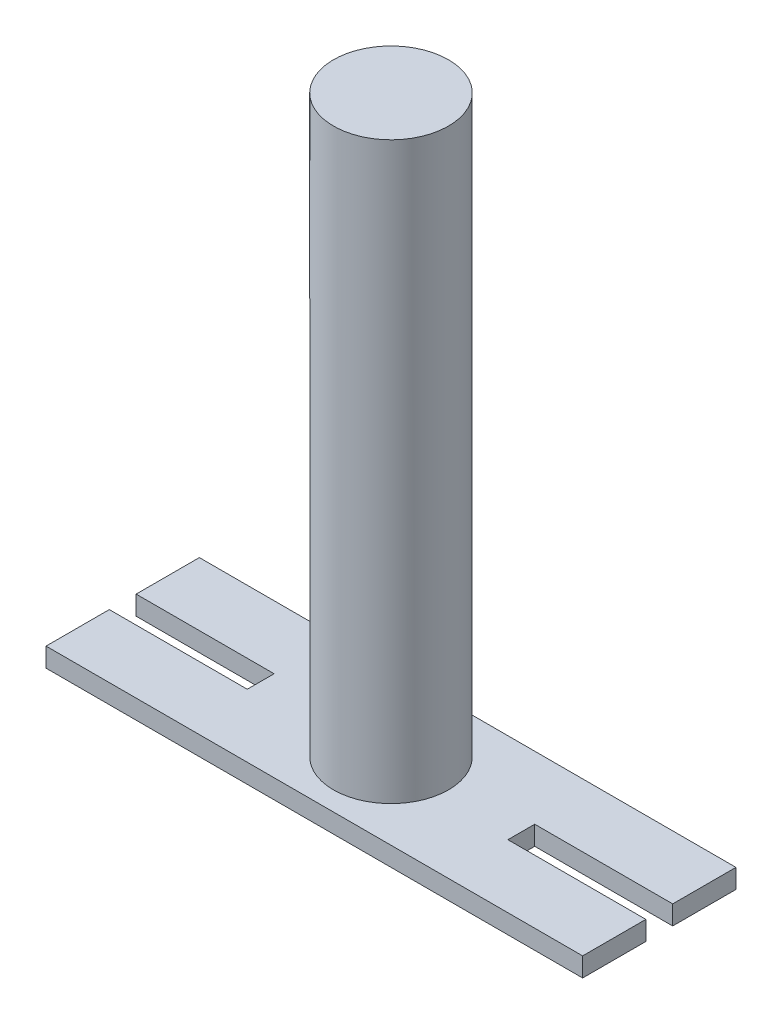
ISO-10303-21;
HEADER;
FILE_DESCRIPTION(('STEP AP214'),'2;1');
FILE_NAME('part.step','',(''),(''),'','','');
FILE_SCHEMA(('AUTOMOTIVE_DESIGN { 1 0 10303 214 1 1 1 1 }'));
ENDSEC;
DATA;
#1=APPLICATION_CONTEXT('core data for automotive mechanical design processes');
#2=APPLICATION_PROTOCOL_DEFINITION('international standard','automotive_design',2000,#1);
#3=PRODUCT_CONTEXT('',#1,'mechanical');
#4=PRODUCT('Part','Part','',(#3));
#5=PRODUCT_RELATED_PRODUCT_CATEGORY('part','',(#4));
#6=PRODUCT_DEFINITION_FORMATION('','',#4);
#7=PRODUCT_DEFINITION_CONTEXT('part definition',#1,'design');
#8=PRODUCT_DEFINITION('design','',#6,#7);
#9=PRODUCT_DEFINITION_SHAPE('','',#8);
#10=(LENGTH_UNIT() NAMED_UNIT(*) SI_UNIT(.MILLI.,.METRE.));
#11=(NAMED_UNIT(*) PLANE_ANGLE_UNIT() SI_UNIT($,.RADIAN.));
#12=(NAMED_UNIT(*) SI_UNIT($,.STERADIAN.) SOLID_ANGLE_UNIT());
#13=UNCERTAINTY_MEASURE_WITH_UNIT(LENGTH_MEASURE(1.E-05),#10,'distance_accuracy_value','');
#14=(GEOMETRIC_REPRESENTATION_CONTEXT(3) GLOBAL_UNCERTAINTY_ASSIGNED_CONTEXT((#13)) GLOBAL_UNIT_ASSIGNED_CONTEXT((#10,
#11,#12)) REPRESENTATION_CONTEXT('',''));
#15=CARTESIAN_POINT('',(0.,0.,0.));
#16=DIRECTION('',(0.,0.,1.));
#17=DIRECTION('',(1.,0.,0.));
#18=AXIS2_PLACEMENT_3D('',#15,#16,#17);
#19=CARTESIAN_POINT('',(0.,127.,0.));
#20=DIRECTION('',(0.,1.,0.));
#21=DIRECTION('',(0.,0.,1.));
#22=AXIS2_PLACEMENT_3D('',#19,#20,#21);
#23=PLANE('',#22);
#24=CARTESIAN_POINT('',(0.,127.,0.));
#25=DIRECTION('',(0.,1.,0.));
#26=DIRECTION('',(0.,0.,1.));
#27=AXIS2_PLACEMENT_3D('',#24,#25,#26);
#28=CIRCLE('',#27,381.);
#29=CARTESIAN_POINT('',(0.,127.,381.));
#30=VERTEX_POINT('',#29);
#31=EDGE_CURVE('E12',#30,#30,#28,.T.);
#32=ORIENTED_EDGE('',*,*,#31,.F.);
#33=EDGE_LOOP('',(#32));
#34=FACE_BOUND('',#33,.T.);
#35=DIRECTION('',(0.,0.,1.));
#36=VECTOR('',#35,1.);
#37=CARTESIAN_POINT('',(1778.,127.,9.42007414833465E-13));
#38=LINE('',#37,#36);
#39=CARTESIAN_POINT('',(1778.,127.,88.8999999999994));
#40=VERTEX_POINT('',#39);
#41=CARTESIAN_POINT('',(1778.,127.,508.));
#42=VERTEX_POINT('',#41);
#43=EDGE_CURVE('E222',#40,#42,#38,.T.);
#44=ORIENTED_EDGE('',*,*,#43,.F.);
#45=DIRECTION('',(-1.,0.,0.));
#46=VECTOR('',#45,1.);
#47=CARTESIAN_POINT('',(0.,127.,88.9000000000002));
#48=LINE('',#47,#46);
#49=CARTESIAN_POINT('',(863.6,127.,88.8999999999998));
#50=VERTEX_POINT('',#49);
#51=EDGE_CURVE('E246',#40,#50,#48,.T.);
#52=ORIENTED_EDGE('',*,*,#51,.T.);
#53=DIRECTION('',(0.,0.,-1.));
#54=VECTOR('',#53,1.);
#55=CARTESIAN_POINT('',(863.6,127.,-1.07850236677872E-12));
#56=LINE('',#55,#54);
#57=CARTESIAN_POINT('',(863.6,127.,-88.9000000000004));
#58=VERTEX_POINT('',#57);
#59=EDGE_CURVE('E314',#50,#58,#56,.T.);
#60=ORIENTED_EDGE('',*,*,#59,.T.);
#61=DIRECTION('',(-1.,0.,0.));
#62=VECTOR('',#61,1.);
#63=CARTESIAN_POINT('',(0.,127.,-88.9000000000004));
#64=LINE('',#63,#62);
#65=CARTESIAN_POINT('',(1778.,127.,-88.9000000000004));
#66=VERTEX_POINT('',#65);
#67=EDGE_CURVE('E310',#66,#58,#64,.T.);
#68=ORIENTED_EDGE('',*,*,#67,.F.);
#69=DIRECTION('',(0.,0.,1.));
#70=VECTOR('',#69,1.);
#71=CARTESIAN_POINT('',(1778.,127.,0.));
#72=LINE('',#71,#70);
#73=CARTESIAN_POINT('',(1778.,127.,-508.));
#74=VERTEX_POINT('',#73);
#75=EDGE_CURVE('E313',#74,#66,#72,.T.);
#76=ORIENTED_EDGE('',*,*,#75,.F.);
#77=DIRECTION('',(-1.,0.,0.));
#78=VECTOR('',#77,1.);
#79=CARTESIAN_POINT('',(0.,127.,-508.));
#80=LINE('',#79,#78);
#81=CARTESIAN_POINT('',(-1778.,127.,-508.));
#82=VERTEX_POINT('',#81);
#83=EDGE_CURVE('E316',#74,#82,#80,.T.);
#84=ORIENTED_EDGE('',*,*,#83,.T.);
#85=DIRECTION('',(0.,0.,1.));
#86=VECTOR('',#85,1.);
#87=CARTESIAN_POINT('',(-1778.,127.,0.));
#88=LINE('',#87,#86);
#89=CARTESIAN_POINT('',(-1778.,127.,-88.9));
#90=VERTEX_POINT('',#89);
#91=EDGE_CURVE('E322',#82,#90,#88,.T.);
#92=ORIENTED_EDGE('',*,*,#91,.T.);
#93=DIRECTION('',(1.,0.,0.));
#94=VECTOR('',#93,1.);
#95=CARTESIAN_POINT('',(0.,127.,-88.9000000000004));
#96=LINE('',#95,#94);
#97=CARTESIAN_POINT('',(-863.6,127.,-88.9000000000002));
#98=VERTEX_POINT('',#97);
#99=EDGE_CURVE('E187',#90,#98,#96,.T.);
#100=ORIENTED_EDGE('',*,*,#99,.T.);
#101=DIRECTION('',(0.,0.,-1.));
#102=VECTOR('',#101,1.);
#103=CARTESIAN_POINT('',(-863.6,127.,0.));
#104=LINE('',#103,#102);
#105=CARTESIAN_POINT('',(-863.6,127.,88.9000000000002));
#106=VERTEX_POINT('',#105);
#107=EDGE_CURVE('E185',#106,#98,#104,.T.);
#108=ORIENTED_EDGE('',*,*,#107,.F.);
#109=DIRECTION('',(1.,0.,0.));
#110=VECTOR('',#109,1.);
#111=CARTESIAN_POINT('',(0.,127.,88.9000000000002));
#112=LINE('',#111,#110);
#113=CARTESIAN_POINT('',(-1778.,127.,88.9000000000002));
#114=VERTEX_POINT('',#113);
#115=EDGE_CURVE('E169',#114,#106,#112,.T.);
#116=ORIENTED_EDGE('',*,*,#115,.F.);
#117=DIRECTION('',(0.,0.,1.));
#118=VECTOR('',#117,1.);
#119=CARTESIAN_POINT('',(-1778.,127.,1.88401482966693E-12));
#120=LINE('',#119,#118);
#121=CARTESIAN_POINT('',(-1778.,127.,508.));
#122=VERTEX_POINT('',#121);
#123=EDGE_CURVE('E176',#114,#122,#120,.T.);
#124=ORIENTED_EDGE('',*,*,#123,.T.);
#125=DIRECTION('',(-1.,0.,0.));
#126=VECTOR('',#125,1.);
#127=CARTESIAN_POINT('',(0.,127.,508.));
#128=LINE('',#127,#126);
#129=EDGE_CURVE('E180',#42,#122,#128,.T.);
#130=ORIENTED_EDGE('',*,*,#129,.F.);
#131=EDGE_LOOP('',(#44,#52,#60,#68,#76,#84,#92,#100,#108,#116,#124,#130));
#132=FACE_BOUND('',#131,.T.);
#133=ADVANCED_FACE('F72',(#34,#132),#23,.T.);
#134=CARTESIAN_POINT('',(0.,0.,0.));
#135=DIRECTION('',(0.,1.,0.));
#136=DIRECTION('',(0.,0.,1.));
#137=AXIS2_PLACEMENT_3D('',#134,#135,#136);
#138=PLANE('',#137);
#139=DIRECTION('',(0.,0.,1.));
#140=VECTOR('',#139,1.);
#141=CARTESIAN_POINT('',(1778.,0.,9.42007414833465E-13));
#142=LINE('',#141,#140);
#143=CARTESIAN_POINT('',(1778.,0.,88.8999999999994));
#144=VERTEX_POINT('',#143);
#145=CARTESIAN_POINT('',(1778.,0.,508.));
#146=VERTEX_POINT('',#145);
#147=EDGE_CURVE('E192',#144,#146,#142,.T.);
#148=ORIENTED_EDGE('',*,*,#147,.T.);
#149=DIRECTION('',(-1.,0.,0.));
#150=VECTOR('',#149,1.);
#151=CARTESIAN_POINT('',(0.,0.,508.));
#152=LINE('',#151,#150);
#153=CARTESIAN_POINT('',(-1778.,0.,508.));
#154=VERTEX_POINT('',#153);
#155=EDGE_CURVE('E219',#146,#154,#152,.T.);
#156=ORIENTED_EDGE('',*,*,#155,.T.);
#157=DIRECTION('',(0.,0.,1.));
#158=VECTOR('',#157,1.);
#159=CARTESIAN_POINT('',(-1778.,0.,1.88401482966693E-12));
#160=LINE('',#159,#158);
#161=CARTESIAN_POINT('',(-1778.,0.,88.9000000000002));
#162=VERTEX_POINT('',#161);
#163=EDGE_CURVE('E217',#162,#154,#160,.T.);
#164=ORIENTED_EDGE('',*,*,#163,.F.);
#165=DIRECTION('',(1.,0.,0.));
#166=VECTOR('',#165,1.);
#167=CARTESIAN_POINT('',(0.,0.,88.9000000000002));
#168=LINE('',#167,#166);
#169=CARTESIAN_POINT('',(-863.6,0.,88.9000000000002));
#170=VERTEX_POINT('',#169);
#171=EDGE_CURVE('E171',#162,#170,#168,.T.);
#172=ORIENTED_EDGE('',*,*,#171,.T.);
#173=DIRECTION('',(0.,0.,-1.));
#174=VECTOR('',#173,1.);
#175=CARTESIAN_POINT('',(-863.6,0.,0.));
#176=LINE('',#175,#174);
#177=CARTESIAN_POINT('',(-863.6,0.,-88.9000000000002));
#178=VERTEX_POINT('',#177);
#179=EDGE_CURVE('E213',#170,#178,#176,.T.);
#180=ORIENTED_EDGE('',*,*,#179,.T.);
#181=DIRECTION('',(1.,0.,0.));
#182=VECTOR('',#181,1.);
#183=CARTESIAN_POINT('',(0.,0.,-88.9000000000004));
#184=LINE('',#183,#182);
#185=CARTESIAN_POINT('',(-1778.,0.,-88.9));
#186=VERTEX_POINT('',#185);
#187=EDGE_CURVE('E210',#186,#178,#184,.T.);
#188=ORIENTED_EDGE('',*,*,#187,.F.);
#189=DIRECTION('',(0.,0.,1.));
#190=VECTOR('',#189,1.);
#191=CARTESIAN_POINT('',(-1778.,0.,0.));
#192=LINE('',#191,#190);
#193=CARTESIAN_POINT('',(-1778.,0.,-508.));
#194=VERTEX_POINT('',#193);
#195=EDGE_CURVE('E208',#194,#186,#192,.T.);
#196=ORIENTED_EDGE('',*,*,#195,.F.);
#197=DIRECTION('',(-1.,0.,0.));
#198=VECTOR('',#197,1.);
#199=CARTESIAN_POINT('',(0.,0.,-508.));
#200=LINE('',#199,#198);
#201=CARTESIAN_POINT('',(1778.,0.,-508.));
#202=VERTEX_POINT('',#201);
#203=EDGE_CURVE('E206',#202,#194,#200,.T.);
#204=ORIENTED_EDGE('',*,*,#203,.F.);
#205=DIRECTION('',(0.,0.,1.));
#206=VECTOR('',#205,1.);
#207=CARTESIAN_POINT('',(1778.,0.,0.));
#208=LINE('',#207,#206);
#209=CARTESIAN_POINT('',(1778.,0.,-88.9000000000004));
#210=VERTEX_POINT('',#209);
#211=EDGE_CURVE('E203',#202,#210,#208,.T.);
#212=ORIENTED_EDGE('',*,*,#211,.T.);
#213=DIRECTION('',(-1.,0.,0.));
#214=VECTOR('',#213,1.);
#215=CARTESIAN_POINT('',(0.,0.,-88.9000000000004));
#216=LINE('',#215,#214);
#217=CARTESIAN_POINT('',(863.6,0.,-88.9000000000004));
#218=VERTEX_POINT('',#217);
#219=EDGE_CURVE('E200',#210,#218,#216,.T.);
#220=ORIENTED_EDGE('',*,*,#219,.T.);
#221=DIRECTION('',(0.,0.,-1.));
#222=VECTOR('',#221,1.);
#223=CARTESIAN_POINT('',(863.6,0.,-1.07850236677872E-12));
#224=LINE('',#223,#222);
#225=CARTESIAN_POINT('',(863.6,0.,88.8999999999998));
#226=VERTEX_POINT('',#225);
#227=EDGE_CURVE('E197',#226,#218,#224,.T.);
#228=ORIENTED_EDGE('',*,*,#227,.F.);
#229=DIRECTION('',(-1.,0.,0.));
#230=VECTOR('',#229,1.);
#231=CARTESIAN_POINT('',(0.,0.,88.9000000000002));
#232=LINE('',#231,#230);
#233=EDGE_CURVE('E194',#144,#226,#232,.T.);
#234=ORIENTED_EDGE('',*,*,#233,.F.);
#235=EDGE_LOOP('',(#148,#156,#164,#172,#180,#188,#196,#204,#212,#220,#228,#234));
#236=FACE_BOUND('',#235,.T.);
#237=CARTESIAN_POINT('',(4.44089209850063E-13,0.,-1.11022302462516E-13));
#238=DIRECTION('',(0.,1.,0.));
#239=DIRECTION('',(0.,0.,1.));
#240=AXIS2_PLACEMENT_3D('',#237,#238,#239);
#241=CIRCLE('',#240,254.);
#242=CARTESIAN_POINT('',(4.44089209850063E-13,0.,254.));
#243=VERTEX_POINT('',#242);
#244=EDGE_CURVE('E195',#243,#243,#241,.T.);
#245=ORIENTED_EDGE('',*,*,#244,.T.);
#246=EDGE_LOOP('',(#245));
#247=FACE_BOUND('',#246,.T.);
#248=ADVANCED_FACE('F249',(#236,#247),#138,.F.);
#249=CARTESIAN_POINT('',(1778.,127.,9.42007414833465E-13));
#250=DIRECTION('',(1.,0.,0.));
#251=DIRECTION('',(0.,0.,-1.));
#252=AXIS2_PLACEMENT_3D('',#249,#250,#251);
#253=PLANE('',#252);
#254=ORIENTED_EDGE('',*,*,#147,.F.);
#255=DIRECTION('',(0.,-1.,0.));
#256=VECTOR('',#255,1.);
#257=CARTESIAN_POINT('',(1778.,127.,88.8999999999994));
#258=LINE('',#257,#256);
#259=EDGE_CURVE('E81',#40,#144,#258,.T.);
#260=ORIENTED_EDGE('',*,*,#259,.F.);
#261=ORIENTED_EDGE('',*,*,#43,.T.);
#262=DIRECTION('',(0.,-1.,0.));
#263=VECTOR('',#262,1.);
#264=CARTESIAN_POINT('',(1778.,127.,508.));
#265=LINE('',#264,#263);
#266=EDGE_CURVE('E89',#42,#146,#265,.T.);
#267=ORIENTED_EDGE('',*,*,#266,.T.);
#268=EDGE_LOOP('',(#254,#260,#261,#267));
#269=FACE_BOUND('',#268,.T.);
#270=ADVANCED_FACE('F74',(#269),#253,.T.);
#271=CARTESIAN_POINT('',(0.,127.,88.9000000000002));
#272=DIRECTION('',(0.,0.,1.));
#273=DIRECTION('',(1.,0.,0.));
#274=AXIS2_PLACEMENT_3D('',#271,#272,#273);
#275=PLANE('',#274);
#276=ORIENTED_EDGE('',*,*,#233,.T.);
#277=DIRECTION('',(0.,-1.,0.));
#278=VECTOR('',#277,1.);
#279=CARTESIAN_POINT('',(863.6,127.,88.8999999999998));
#280=LINE('',#279,#278);
#281=EDGE_CURVE('E240',#50,#226,#280,.T.);
#282=ORIENTED_EDGE('',*,*,#281,.F.);
#283=ORIENTED_EDGE('',*,*,#51,.F.);
#284=ORIENTED_EDGE('',*,*,#259,.T.);
#285=EDGE_LOOP('',(#276,#282,#283,#284));
#286=FACE_BOUND('',#285,.T.);
#287=ADVANCED_FACE('F244',(#286),#275,.F.);
#288=CARTESIAN_POINT('',(863.6,127.,-1.07850236677872E-12));
#289=DIRECTION('',(-1.,0.,0.));
#290=DIRECTION('',(0.,0.,1.));
#291=AXIS2_PLACEMENT_3D('',#288,#289,#290);
#292=PLANE('',#291);
#293=ORIENTED_EDGE('',*,*,#227,.T.);
#294=DIRECTION('',(0.,-1.,0.));
#295=VECTOR('',#294,1.);
#296=CARTESIAN_POINT('',(863.6,127.,-88.9000000000004));
#297=LINE('',#296,#295);
#298=EDGE_CURVE('E238',#58,#218,#297,.T.);
#299=ORIENTED_EDGE('',*,*,#298,.F.);
#300=ORIENTED_EDGE('',*,*,#59,.F.);
#301=ORIENTED_EDGE('',*,*,#281,.T.);
#302=EDGE_LOOP('',(#293,#299,#300,#301));
#303=FACE_BOUND('',#302,.T.);
#304=ADVANCED_FACE('F256',(#303),#292,.F.);
#305=CARTESIAN_POINT('',(0.,127.,-88.9000000000004));
#306=DIRECTION('',(0.,0.,1.));
#307=DIRECTION('',(1.,0.,0.));
#308=AXIS2_PLACEMENT_3D('',#305,#306,#307);
#309=PLANE('',#308);
#310=ORIENTED_EDGE('',*,*,#219,.F.);
#311=DIRECTION('',(0.,-1.,0.));
#312=VECTOR('',#311,1.);
#313=CARTESIAN_POINT('',(1778.,127.,-88.9000000000004));
#314=LINE('',#313,#312);
#315=EDGE_CURVE('E236',#66,#210,#314,.T.);
#316=ORIENTED_EDGE('',*,*,#315,.F.);
#317=ORIENTED_EDGE('',*,*,#67,.T.);
#318=ORIENTED_EDGE('',*,*,#298,.T.);
#319=EDGE_LOOP('',(#310,#316,#317,#318));
#320=FACE_BOUND('',#319,.T.);
#321=ADVANCED_FACE('F294',(#320),#309,.T.);
#322=CARTESIAN_POINT('',(1778.,127.,0.));
#323=DIRECTION('',(1.,0.,0.));
#324=DIRECTION('',(0.,0.,-1.));
#325=AXIS2_PLACEMENT_3D('',#322,#323,#324);
#326=PLANE('',#325);
#327=ORIENTED_EDGE('',*,*,#211,.F.);
#328=DIRECTION('',(0.,-1.,0.));
#329=VECTOR('',#328,1.);
#330=CARTESIAN_POINT('',(1778.,127.,-508.));
#331=LINE('',#330,#329);
#332=EDGE_CURVE('E234',#74,#202,#331,.T.);
#333=ORIENTED_EDGE('',*,*,#332,.F.);
#334=ORIENTED_EDGE('',*,*,#75,.T.);
#335=ORIENTED_EDGE('',*,*,#315,.T.);
#336=EDGE_LOOP('',(#327,#333,#334,#335));
#337=FACE_BOUND('',#336,.T.);
#338=ADVANCED_FACE('F290',(#337),#326,.T.);
#339=CARTESIAN_POINT('',(0.,127.,-508.));
#340=DIRECTION('',(0.,0.,1.));
#341=DIRECTION('',(1.,0.,0.));
#342=AXIS2_PLACEMENT_3D('',#339,#340,#341);
#343=PLANE('',#342);
#344=ORIENTED_EDGE('',*,*,#203,.T.);
#345=DIRECTION('',(0.,-1.,0.));
#346=VECTOR('',#345,1.);
#347=CARTESIAN_POINT('',(-1778.,127.,-508.));
#348=LINE('',#347,#346);
#349=EDGE_CURVE('E231',#82,#194,#348,.T.);
#350=ORIENTED_EDGE('',*,*,#349,.F.);
#351=ORIENTED_EDGE('',*,*,#83,.F.);
#352=ORIENTED_EDGE('',*,*,#332,.T.);
#353=EDGE_LOOP('',(#344,#350,#351,#352));
#354=FACE_BOUND('',#353,.T.);
#355=ADVANCED_FACE('F286',(#354),#343,.F.);
#356=CARTESIAN_POINT('',(-1778.,127.,0.));
#357=DIRECTION('',(1.,0.,0.));
#358=DIRECTION('',(0.,0.,-1.));
#359=AXIS2_PLACEMENT_3D('',#356,#357,#358);
#360=PLANE('',#359);
#361=ORIENTED_EDGE('',*,*,#195,.T.);
#362=DIRECTION('',(0.,-1.,0.));
#363=VECTOR('',#362,1.);
#364=CARTESIAN_POINT('',(-1778.,127.,-88.9));
#365=LINE('',#364,#363);
#366=EDGE_CURVE('E228',#90,#186,#365,.T.);
#367=ORIENTED_EDGE('',*,*,#366,.F.);
#368=ORIENTED_EDGE('',*,*,#91,.F.);
#369=ORIENTED_EDGE('',*,*,#349,.T.);
#370=EDGE_LOOP('',(#361,#367,#368,#369));
#371=FACE_BOUND('',#370,.T.);
#372=ADVANCED_FACE('F282',(#371),#360,.F.);
#373=CARTESIAN_POINT('',(0.,127.,-88.9000000000004));
#374=DIRECTION('',(0.,0.,-1.));
#375=DIRECTION('',(-1.,0.,0.));
#376=AXIS2_PLACEMENT_3D('',#373,#374,#375);
#377=PLANE('',#376);
#378=ORIENTED_EDGE('',*,*,#187,.T.);
#379=DIRECTION('',(0.,-1.,0.));
#380=VECTOR('',#379,1.);
#381=CARTESIAN_POINT('',(-863.6,127.,-88.9000000000002));
#382=LINE('',#381,#380);
#383=EDGE_CURVE('E226',#98,#178,#382,.T.);
#384=ORIENTED_EDGE('',*,*,#383,.F.);
#385=ORIENTED_EDGE('',*,*,#99,.F.);
#386=ORIENTED_EDGE('',*,*,#366,.T.);
#387=EDGE_LOOP('',(#378,#384,#385,#386));
#388=FACE_BOUND('',#387,.T.);
#389=ADVANCED_FACE('F278',(#388),#377,.F.);
#390=CARTESIAN_POINT('',(-863.6,127.,0.));
#391=DIRECTION('',(-1.,0.,0.));
#392=DIRECTION('',(0.,0.,1.));
#393=AXIS2_PLACEMENT_3D('',#390,#391,#392);
#394=PLANE('',#393);
#395=ORIENTED_EDGE('',*,*,#179,.F.);
#396=DIRECTION('',(0.,-1.,0.));
#397=VECTOR('',#396,1.);
#398=CARTESIAN_POINT('',(-863.6,127.,88.9000000000002));
#399=LINE('',#398,#397);
#400=EDGE_CURVE('E174',#106,#170,#399,.T.);
#401=ORIENTED_EDGE('',*,*,#400,.F.);
#402=ORIENTED_EDGE('',*,*,#107,.T.);
#403=ORIENTED_EDGE('',*,*,#383,.T.);
#404=EDGE_LOOP('',(#395,#401,#402,#403));
#405=FACE_BOUND('',#404,.T.);
#406=ADVANCED_FACE('F275',(#405),#394,.T.);
#407=CARTESIAN_POINT('',(0.,127.,88.9000000000002));
#408=DIRECTION('',(0.,0.,-1.));
#409=DIRECTION('',(-1.,0.,0.));
#410=AXIS2_PLACEMENT_3D('',#407,#408,#409);
#411=PLANE('',#410);
#412=ORIENTED_EDGE('',*,*,#171,.F.);
#413=DIRECTION('',(0.,-1.,0.));
#414=VECTOR('',#413,1.);
#415=CARTESIAN_POINT('',(-1778.,127.,88.9000000000002));
#416=LINE('',#415,#414);
#417=EDGE_CURVE('E165',#114,#162,#416,.T.);
#418=ORIENTED_EDGE('',*,*,#417,.F.);
#419=ORIENTED_EDGE('',*,*,#115,.T.);
#420=ORIENTED_EDGE('',*,*,#400,.T.);
#421=EDGE_LOOP('',(#412,#418,#419,#420));
#422=FACE_BOUND('',#421,.T.);
#423=ADVANCED_FACE('F167',(#422),#411,.T.);
#424=CARTESIAN_POINT('',(-1778.,127.,1.88401482966693E-12));
#425=DIRECTION('',(1.,0.,0.));
#426=DIRECTION('',(0.,0.,-1.));
#427=AXIS2_PLACEMENT_3D('',#424,#425,#426);
#428=PLANE('',#427);
#429=ORIENTED_EDGE('',*,*,#163,.T.);
#430=DIRECTION('',(0.,-1.,0.));
#431=VECTOR('',#430,1.);
#432=CARTESIAN_POINT('',(-1778.,127.,508.));
#433=LINE('',#432,#431);
#434=EDGE_CURVE('E128',#122,#154,#433,.T.);
#435=ORIENTED_EDGE('',*,*,#434,.F.);
#436=ORIENTED_EDGE('',*,*,#123,.F.);
#437=ORIENTED_EDGE('',*,*,#417,.T.);
#438=EDGE_LOOP('',(#429,#435,#436,#437));
#439=FACE_BOUND('',#438,.T.);
#440=ADVANCED_FACE('F177',(#439),#428,.F.);
#441=CARTESIAN_POINT('',(0.,127.,508.));
#442=DIRECTION('',(0.,0.,1.));
#443=DIRECTION('',(1.,0.,0.));
#444=AXIS2_PLACEMENT_3D('',#441,#442,#443);
#445=PLANE('',#444);
#446=ORIENTED_EDGE('',*,*,#155,.F.);
#447=ORIENTED_EDGE('',*,*,#266,.F.);
#448=ORIENTED_EDGE('',*,*,#129,.T.);
#449=ORIENTED_EDGE('',*,*,#434,.T.);
#450=EDGE_LOOP('',(#446,#447,#448,#449));
#451=FACE_BOUND('',#450,.T.);
#452=ADVANCED_FACE('F268',(#451),#445,.T.);
#453=CARTESIAN_POINT('',(4.44089209850063E-13,127.,-1.11022302462516E-13));
#454=DIRECTION('',(0.,-1.,0.));
#455=DIRECTION('',(0.,0.,-1.));
#456=AXIS2_PLACEMENT_3D('',#453,#454,#455);
#457=CYLINDRICAL_SURFACE('',#456,254.);
#458=ORIENTED_EDGE('',*,*,#244,.F.);
#459=EDGE_LOOP('',(#458));
#460=FACE_BOUND('',#459,.T.);
#461=CARTESIAN_POINT('',(0.,3810.,0.));
#462=DIRECTION('',(0.,-1.,0.));
#463=DIRECTION('',(0.,0.,-1.));
#464=AXIS2_PLACEMENT_3D('',#461,#462,#463);
#465=CIRCLE('',#464,254.);
#466=CARTESIAN_POINT('',(0.,3810.,-254.));
#467=VERTEX_POINT('',#466);
#468=EDGE_CURVE('E339',#467,#467,#465,.T.);
#469=ORIENTED_EDGE('',*,*,#468,.F.);
#470=EDGE_LOOP('',(#469));
#471=FACE_BOUND('',#470,.T.);
#472=ADVANCED_FACE('F265',(#460,#471),#457,.F.);
#473=CARTESIAN_POINT('',(254.,3810.,0.));
#474=DIRECTION('',(0.,-1.,0.));
#475=DIRECTION('',(0.,0.,-1.));
#476=AXIS2_PLACEMENT_3D('',#473,#474,#475);
#477=PLANE('',#476);
#478=ORIENTED_EDGE('',*,*,#468,.T.);
#479=EDGE_LOOP('',(#478));
#480=FACE_BOUND('',#479,.T.);
#481=ADVANCED_FACE('F343',(#480),#477,.T.);
#482=CARTESIAN_POINT('',(0.,3937.,0.));
#483=DIRECTION('',(0.,1.,0.));
#484=DIRECTION('',(0.,0.,1.));
#485=AXIS2_PLACEMENT_3D('',#482,#483,#484);
#486=PLANE('',#485);
#487=CARTESIAN_POINT('',(0.,3937.,0.));
#488=DIRECTION('',(0.,-1.,0.));
#489=DIRECTION('',(0.,0.,-1.));
#490=AXIS2_PLACEMENT_3D('',#487,#488,#489);
#491=CIRCLE('',#490,381.);
#492=CARTESIAN_POINT('',(0.,3937.,-381.));
#493=VERTEX_POINT('',#492);
#494=EDGE_CURVE('E336',#493,#493,#491,.T.);
#495=ORIENTED_EDGE('',*,*,#494,.F.);
#496=EDGE_LOOP('',(#495));
#497=FACE_BOUND('',#496,.T.);
#498=ADVANCED_FACE('F350',(#497),#486,.T.);
#499=CARTESIAN_POINT('',(0.,0.,0.));
#500=DIRECTION('',(0.,-1.,0.));
#501=DIRECTION('',(0.,0.,-1.));
#502=AXIS2_PLACEMENT_3D('',#499,#500,#501);
#503=CYLINDRICAL_SURFACE('',#502,381.);
#504=ORIENTED_EDGE('',*,*,#494,.T.);
#505=EDGE_LOOP('',(#504));
#506=FACE_BOUND('',#505,.T.);
#507=ORIENTED_EDGE('',*,*,#31,.T.);
#508=EDGE_LOOP('',(#507));
#509=FACE_BOUND('',#508,.T.);
#510=ADVANCED_FACE('F356',(#506,#509),#503,.T.);
#511=CLOSED_SHELL('',(#133,#248,#270,#287,#304,#321,#338,#355,#372,#389,#406,#423,#440,#452,
#472,#481,#498,#510));
#512=MANIFOLD_SOLID_BREP('B2',#511);
#513=ADVANCED_BREP_SHAPE_REPRESENTATION('',(#18,#512),#14);
#514=SHAPE_DEFINITION_REPRESENTATION(#9,#513);
ENDSEC;
END-ISO-10303-21;
